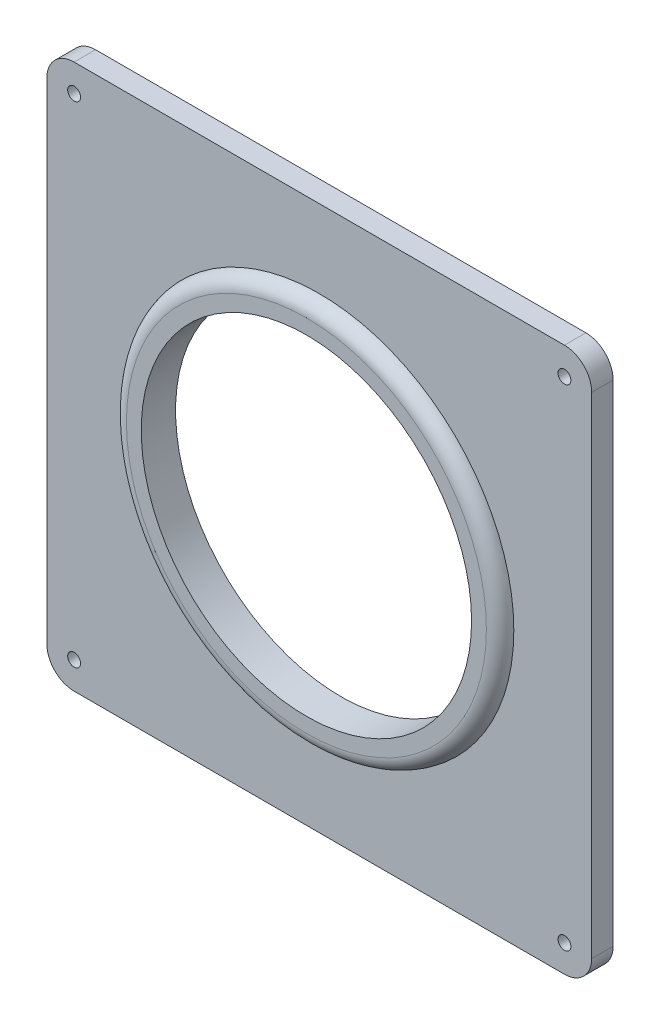
ISO-10303-21;
HEADER;
FILE_DESCRIPTION(('STEP AP214'),'2;1');
FILE_NAME('part.step','',(''),(''),'','','');
FILE_SCHEMA(('AUTOMOTIVE_DESIGN { 1 0 10303 214 1 1 1 1 }'));
ENDSEC;
DATA;
#1=APPLICATION_CONTEXT('core data for automotive mechanical design processes');
#2=APPLICATION_PROTOCOL_DEFINITION('international standard','automotive_design',2000,#1);
#3=PRODUCT_CONTEXT('',#1,'mechanical');
#4=PRODUCT('Part','Part','',(#3));
#5=PRODUCT_RELATED_PRODUCT_CATEGORY('part','',(#4));
#6=PRODUCT_DEFINITION_FORMATION('','',#4);
#7=PRODUCT_DEFINITION_CONTEXT('part definition',#1,'design');
#8=PRODUCT_DEFINITION('design','',#6,#7);
#9=PRODUCT_DEFINITION_SHAPE('','',#8);
#10=(LENGTH_UNIT() NAMED_UNIT(*) SI_UNIT(.MILLI.,.METRE.));
#11=(NAMED_UNIT(*) PLANE_ANGLE_UNIT() SI_UNIT($,.RADIAN.));
#12=(NAMED_UNIT(*) SI_UNIT($,.STERADIAN.) SOLID_ANGLE_UNIT());
#13=UNCERTAINTY_MEASURE_WITH_UNIT(LENGTH_MEASURE(1.E-05),#10,'distance_accuracy_value','');
#14=(GEOMETRIC_REPRESENTATION_CONTEXT(3) GLOBAL_UNCERTAINTY_ASSIGNED_CONTEXT((#13)) GLOBAL_UNIT_ASSIGNED_CONTEXT((#10,
#11,#12)) REPRESENTATION_CONTEXT('',''));
#15=CARTESIAN_POINT('',(0.,0.,0.));
#16=DIRECTION('',(0.,0.,1.));
#17=DIRECTION('',(1.,0.,0.));
#18=AXIS2_PLACEMENT_3D('',#15,#16,#17);
#19=CARTESIAN_POINT('',(0.,0.,5.));
#20=DIRECTION('',(0.,0.,1.));
#21=DIRECTION('',(1.,0.,0.));
#22=AXIS2_PLACEMENT_3D('',#19,#20,#21);
#23=PLANE('',#22);
#24=CARTESIAN_POINT('',(-57.15,-57.15,5.));
#25=DIRECTION('',(0.,0.,1.));
#26=DIRECTION('',(1.,0.,0.));
#27=AXIS2_PLACEMENT_3D('',#24,#25,#26);
#28=CIRCLE('',#27,1.5);
#29=CARTESIAN_POINT('',(-55.65,-57.15,5.));
#30=VERTEX_POINT('',#29);
#31=EDGE_CURVE('E241',#30,#30,#28,.F.);
#32=ORIENTED_EDGE('',*,*,#31,.T.);
#33=EDGE_LOOP('',(#32));
#34=FACE_BOUND('',#33,.T.);
#35=CARTESIAN_POINT('',(-57.15,57.15,5.));
#36=DIRECTION('',(0.,0.,1.));
#37=DIRECTION('',(1.,0.,0.));
#38=AXIS2_PLACEMENT_3D('',#35,#36,#37);
#39=CIRCLE('',#38,1.5);
#40=CARTESIAN_POINT('',(-55.65,57.15,5.));
#41=VERTEX_POINT('',#40);
#42=EDGE_CURVE('E217',#41,#41,#39,.T.);
#43=ORIENTED_EDGE('',*,*,#42,.F.);
#44=EDGE_LOOP('',(#43));
#45=FACE_BOUND('',#44,.T.);
#46=DIRECTION('',(0.,1.,0.));
#47=VECTOR('',#46,1.);
#48=CARTESIAN_POINT('',(63.5,0.,5.));
#49=LINE('',#48,#47);
#50=CARTESIAN_POINT('',(63.5,-57.15,5.));
#51=VERTEX_POINT('',#50);
#52=CARTESIAN_POINT('',(63.5,57.15,5.));
#53=VERTEX_POINT('',#52);
#54=EDGE_CURVE('E141',#51,#53,#49,.T.);
#55=ORIENTED_EDGE('',*,*,#54,.T.);
#56=CARTESIAN_POINT('',(57.15,57.15,5.));
#57=DIRECTION('',(0.,0.,1.));
#58=DIRECTION('',(1.,0.,0.));
#59=AXIS2_PLACEMENT_3D('',#56,#57,#58);
#60=CIRCLE('',#59,6.35);
#61=CARTESIAN_POINT('',(57.15,63.5,5.));
#62=VERTEX_POINT('',#61);
#63=EDGE_CURVE('E167',#53,#62,#60,.T.);
#64=ORIENTED_EDGE('',*,*,#63,.T.);
#65=DIRECTION('',(1.,0.,0.));
#66=VECTOR('',#65,1.);
#67=CARTESIAN_POINT('',(0.,63.5,5.));
#68=LINE('',#67,#66);
#69=CARTESIAN_POINT('',(-57.15,63.5,5.));
#70=VERTEX_POINT('',#69);
#71=EDGE_CURVE('E136',#70,#62,#68,.T.);
#72=ORIENTED_EDGE('',*,*,#71,.F.);
#73=CARTESIAN_POINT('',(-57.15,57.15,5.));
#74=DIRECTION('',(0.,0.,1.));
#75=DIRECTION('',(1.,0.,0.));
#76=AXIS2_PLACEMENT_3D('',#73,#74,#75);
#77=CIRCLE('',#76,6.35);
#78=CARTESIAN_POINT('',(-63.5,57.15,5.));
#79=VERTEX_POINT('',#78);
#80=EDGE_CURVE('E134',#70,#79,#77,.T.);
#81=ORIENTED_EDGE('',*,*,#80,.T.);
#82=DIRECTION('',(0.,1.,0.));
#83=VECTOR('',#82,1.);
#84=CARTESIAN_POINT('',(-63.5,0.,5.));
#85=LINE('',#84,#83);
#86=CARTESIAN_POINT('',(-63.5,-57.15,5.));
#87=VERTEX_POINT('',#86);
#88=EDGE_CURVE('E183',#87,#79,#85,.T.);
#89=ORIENTED_EDGE('',*,*,#88,.F.);
#90=CARTESIAN_POINT('',(-57.15,-57.15,5.));
#91=DIRECTION('',(0.,0.,1.));
#92=DIRECTION('',(1.,0.,0.));
#93=AXIS2_PLACEMENT_3D('',#90,#91,#92);
#94=CIRCLE('',#93,6.35);
#95=CARTESIAN_POINT('',(-57.15,-63.5,5.));
#96=VERTEX_POINT('',#95);
#97=EDGE_CURVE('E61',#87,#96,#94,.T.);
#98=ORIENTED_EDGE('',*,*,#97,.T.);
#99=DIRECTION('',(1.,0.,0.));
#100=VECTOR('',#99,1.);
#101=CARTESIAN_POINT('',(0.,-63.5,5.));
#102=LINE('',#101,#100);
#103=CARTESIAN_POINT('',(57.15,-63.5,5.));
#104=VERTEX_POINT('',#103);
#105=EDGE_CURVE('E188',#96,#104,#102,.T.);
#106=ORIENTED_EDGE('',*,*,#105,.T.);
#107=CARTESIAN_POINT('',(57.15,-57.15,5.));
#108=DIRECTION('',(0.,0.,1.));
#109=DIRECTION('',(1.,0.,0.));
#110=AXIS2_PLACEMENT_3D('',#107,#108,#109);
#111=CIRCLE('',#110,6.35);
#112=EDGE_CURVE('E164',#104,#51,#111,.T.);
#113=ORIENTED_EDGE('',*,*,#112,.T.);
#114=EDGE_LOOP('',(#55,#64,#72,#81,#89,#98,#106,#113));
#115=FACE_BOUND('',#114,.T.);
#116=CARTESIAN_POINT('',(0.,0.,5.));
#117=DIRECTION('',(0.,0.,1.));
#118=DIRECTION('',(1.,0.,0.));
#119=AXIS2_PLACEMENT_3D('',#116,#117,#118);
#120=CIRCLE('',#119,45.35);
#121=CARTESIAN_POINT('',(45.35,0.,5.));
#122=VERTEX_POINT('',#121);
#123=EDGE_CURVE('E202',#122,#122,#120,.T.);
#124=ORIENTED_EDGE('',*,*,#123,.F.);
#125=EDGE_LOOP('',(#124));
#126=FACE_BOUND('',#125,.T.);
#127=CARTESIAN_POINT('',(57.1499999999996,-57.1500000000004,5.));
#128=DIRECTION('',(0.,0.,1.));
#129=DIRECTION('',(1.,0.,0.));
#130=AXIS2_PLACEMENT_3D('',#127,#128,#129);
#131=CIRCLE('',#130,1.5);
#132=CARTESIAN_POINT('',(58.6499999999996,-57.1500000000004,5.));
#133=VERTEX_POINT('',#132);
#134=EDGE_CURVE('E233',#133,#133,#131,.T.);
#135=ORIENTED_EDGE('',*,*,#134,.F.);
#136=EDGE_LOOP('',(#135));
#137=FACE_BOUND('',#136,.T.);
#138=CARTESIAN_POINT('',(57.1499999999996,57.1500000000004,5.));
#139=DIRECTION('',(0.,0.,1.));
#140=DIRECTION('',(1.,0.,0.));
#141=AXIS2_PLACEMENT_3D('',#138,#139,#140);
#142=CIRCLE('',#141,1.5);
#143=CARTESIAN_POINT('',(58.6499999999996,57.1500000000004,5.));
#144=VERTEX_POINT('',#143);
#145=EDGE_CURVE('E225',#144,#144,#142,.F.);
#146=ORIENTED_EDGE('',*,*,#145,.T.);
#147=EDGE_LOOP('',(#146));
#148=FACE_BOUND('',#147,.T.);
#149=ADVANCED_FACE('F38',(#34,#45,#115,#126,#137,#148),#23,.T.);
#150=CARTESIAN_POINT('',(0.,0.,0.));
#151=DIRECTION('',(0.,0.,1.));
#152=DIRECTION('',(1.,0.,0.));
#153=AXIS2_PLACEMENT_3D('',#150,#151,#152);
#154=PLANE('',#153);
#155=CARTESIAN_POINT('',(57.1499999999996,-57.1500000000004,0.));
#156=DIRECTION('',(0.,0.,1.));
#157=DIRECTION('',(1.,0.,0.));
#158=AXIS2_PLACEMENT_3D('',#155,#156,#157);
#159=CIRCLE('',#158,1.5);
#160=CARTESIAN_POINT('',(58.6499999999996,-57.1500000000004,0.));
#161=VERTEX_POINT('',#160);
#162=EDGE_CURVE('E237',#161,#161,#159,.T.);
#163=ORIENTED_EDGE('',*,*,#162,.T.);
#164=EDGE_LOOP('',(#163));
#165=FACE_BOUND('',#164,.T.);
#166=CARTESIAN_POINT('',(-57.15,57.15,0.));
#167=DIRECTION('',(0.,0.,1.));
#168=DIRECTION('',(1.,0.,0.));
#169=AXIS2_PLACEMENT_3D('',#166,#167,#168);
#170=CIRCLE('',#169,1.5);
#171=CARTESIAN_POINT('',(-55.65,57.15,0.));
#172=VERTEX_POINT('',#171);
#173=EDGE_CURVE('E216',#172,#172,#170,.T.);
#174=ORIENTED_EDGE('',*,*,#173,.T.);
#175=EDGE_LOOP('',(#174));
#176=FACE_BOUND('',#175,.T.);
#177=DIRECTION('',(1.,0.,0.));
#178=VECTOR('',#177,1.);
#179=CARTESIAN_POINT('',(0.,63.5,0.));
#180=LINE('',#179,#178);
#181=CARTESIAN_POINT('',(-57.15,63.5,0.));
#182=VERTEX_POINT('',#181);
#183=CARTESIAN_POINT('',(57.15,63.5,0.));
#184=VERTEX_POINT('',#183);
#185=EDGE_CURVE('E110',#182,#184,#180,.T.);
#186=ORIENTED_EDGE('',*,*,#185,.T.);
#187=CARTESIAN_POINT('',(57.15,57.15,0.));
#188=DIRECTION('',(0.,0.,1.));
#189=DIRECTION('',(1.,0.,0.));
#190=AXIS2_PLACEMENT_3D('',#187,#188,#189);
#191=CIRCLE('',#190,6.35);
#192=CARTESIAN_POINT('',(63.5,57.15,0.));
#193=VERTEX_POINT('',#192);
#194=EDGE_CURVE('E150',#184,#193,#191,.F.);
#195=ORIENTED_EDGE('',*,*,#194,.T.);
#196=DIRECTION('',(0.,1.,0.));
#197=VECTOR('',#196,1.);
#198=CARTESIAN_POINT('',(63.5,0.,0.));
#199=LINE('',#198,#197);
#200=CARTESIAN_POINT('',(63.5,-57.15,0.));
#201=VERTEX_POINT('',#200);
#202=EDGE_CURVE('E130',#201,#193,#199,.T.);
#203=ORIENTED_EDGE('',*,*,#202,.F.);
#204=CARTESIAN_POINT('',(57.15,-57.15,0.));
#205=DIRECTION('',(0.,0.,1.));
#206=DIRECTION('',(1.,0.,0.));
#207=AXIS2_PLACEMENT_3D('',#204,#205,#206);
#208=CIRCLE('',#207,6.35);
#209=CARTESIAN_POINT('',(57.15,-63.5,0.));
#210=VERTEX_POINT('',#209);
#211=EDGE_CURVE('E147',#201,#210,#208,.F.);
#212=ORIENTED_EDGE('',*,*,#211,.T.);
#213=DIRECTION('',(1.,0.,0.));
#214=VECTOR('',#213,1.);
#215=CARTESIAN_POINT('',(0.,-63.5,0.));
#216=LINE('',#215,#214);
#217=CARTESIAN_POINT('',(-57.15,-63.5,0.));
#218=VERTEX_POINT('',#217);
#219=EDGE_CURVE('E194',#218,#210,#216,.T.);
#220=ORIENTED_EDGE('',*,*,#219,.F.);
#221=CARTESIAN_POINT('',(-57.15,-57.15,0.));
#222=DIRECTION('',(0.,0.,1.));
#223=DIRECTION('',(1.,0.,0.));
#224=AXIS2_PLACEMENT_3D('',#221,#222,#223);
#225=CIRCLE('',#224,6.35);
#226=CARTESIAN_POINT('',(-63.5,-57.15,0.));
#227=VERTEX_POINT('',#226);
#228=EDGE_CURVE('E118',#218,#227,#225,.F.);
#229=ORIENTED_EDGE('',*,*,#228,.T.);
#230=DIRECTION('',(0.,1.,0.));
#231=VECTOR('',#230,1.);
#232=CARTESIAN_POINT('',(-63.5,0.,0.));
#233=LINE('',#232,#231);
#234=CARTESIAN_POINT('',(-63.5,57.15,0.));
#235=VERTEX_POINT('',#234);
#236=EDGE_CURVE('E112',#227,#235,#233,.T.);
#237=ORIENTED_EDGE('',*,*,#236,.T.);
#238=CARTESIAN_POINT('',(-57.15,57.15,0.));
#239=DIRECTION('',(0.,0.,1.));
#240=DIRECTION('',(1.,0.,0.));
#241=AXIS2_PLACEMENT_3D('',#238,#239,#240);
#242=CIRCLE('',#241,6.35);
#243=EDGE_CURVE('E106',#235,#182,#242,.F.);
#244=ORIENTED_EDGE('',*,*,#243,.T.);
#245=EDGE_LOOP('',(#186,#195,#203,#212,#220,#229,#237,#244));
#246=FACE_BOUND('',#245,.T.);
#247=CARTESIAN_POINT('',(0.,0.,0.));
#248=DIRECTION('',(0.,0.,1.));
#249=DIRECTION('',(1.,0.,0.));
#250=AXIS2_PLACEMENT_3D('',#247,#248,#249);
#251=CIRCLE('',#250,38.5);
#252=CARTESIAN_POINT('',(38.5,0.,0.));
#253=VERTEX_POINT('',#252);
#254=EDGE_CURVE('E129',#253,#253,#251,.T.);
#255=ORIENTED_EDGE('',*,*,#254,.T.);
#256=EDGE_LOOP('',(#255));
#257=FACE_BOUND('',#256,.T.);
#258=CARTESIAN_POINT('',(-57.15,-57.15,0.));
#259=DIRECTION('',(0.,0.,1.));
#260=DIRECTION('',(1.,0.,0.));
#261=AXIS2_PLACEMENT_3D('',#258,#259,#260);
#262=CIRCLE('',#261,1.5);
#263=CARTESIAN_POINT('',(-55.65,-57.15,0.));
#264=VERTEX_POINT('',#263);
#265=EDGE_CURVE('E221',#264,#264,#262,.F.);
#266=ORIENTED_EDGE('',*,*,#265,.F.);
#267=EDGE_LOOP('',(#266));
#268=FACE_BOUND('',#267,.T.);
#269=CARTESIAN_POINT('',(57.1499999999996,57.1500000000004,0.));
#270=DIRECTION('',(0.,0.,1.));
#271=DIRECTION('',(1.,0.,0.));
#272=AXIS2_PLACEMENT_3D('',#269,#270,#271);
#273=CIRCLE('',#272,1.5);
#274=CARTESIAN_POINT('',(58.6499999999996,57.1500000000004,0.));
#275=VERTEX_POINT('',#274);
#276=EDGE_CURVE('E229',#275,#275,#273,.F.);
#277=ORIENTED_EDGE('',*,*,#276,.F.);
#278=EDGE_LOOP('',(#277));
#279=FACE_BOUND('',#278,.T.);
#280=ADVANCED_FACE('F108',(#165,#176,#246,#257,#268,#279),#154,.F.);
#281=CARTESIAN_POINT('',(-63.5,0.,5.));
#282=DIRECTION('',(-1.,0.,0.));
#283=DIRECTION('',(0.,0.,1.));
#284=AXIS2_PLACEMENT_3D('',#281,#282,#283);
#285=PLANE('',#284);
#286=ORIENTED_EDGE('',*,*,#236,.F.);
#287=DIRECTION('',(0.,0.,-1.));
#288=VECTOR('',#287,1.);
#289=CARTESIAN_POINT('',(-63.5,-57.15,5.));
#290=LINE('',#289,#288);
#291=EDGE_CURVE('E47',#227,#87,#290,.F.);
#292=ORIENTED_EDGE('',*,*,#291,.T.);
#293=ORIENTED_EDGE('',*,*,#88,.T.);
#294=DIRECTION('',(0.,0.,-1.));
#295=VECTOR('',#294,1.);
#296=CARTESIAN_POINT('',(-63.5,57.15,5.));
#297=LINE('',#296,#295);
#298=EDGE_CURVE('E176',#79,#235,#297,.T.);
#299=ORIENTED_EDGE('',*,*,#298,.T.);
#300=EDGE_LOOP('',(#286,#292,#293,#299));
#301=FACE_BOUND('',#300,.T.);
#302=ADVANCED_FACE('F182',(#301),#285,.T.);
#303=CARTESIAN_POINT('',(0.,-63.5,5.));
#304=DIRECTION('',(0.,1.,0.));
#305=DIRECTION('',(0.,0.,1.));
#306=AXIS2_PLACEMENT_3D('',#303,#304,#305);
#307=PLANE('',#306);
#308=ORIENTED_EDGE('',*,*,#219,.T.);
#309=DIRECTION('',(0.,0.,-1.));
#310=VECTOR('',#309,1.);
#311=CARTESIAN_POINT('',(57.15,-63.5,5.));
#312=LINE('',#311,#310);
#313=EDGE_CURVE('E54',#210,#104,#312,.F.);
#314=ORIENTED_EDGE('',*,*,#313,.T.);
#315=ORIENTED_EDGE('',*,*,#105,.F.);
#316=DIRECTION('',(0.,0.,-1.));
#317=VECTOR('',#316,1.);
#318=CARTESIAN_POINT('',(-57.15,-63.5,0.));
#319=LINE('',#318,#317);
#320=EDGE_CURVE('E170',#96,#218,#319,.T.);
#321=ORIENTED_EDGE('',*,*,#320,.T.);
#322=EDGE_LOOP('',(#308,#314,#315,#321));
#323=FACE_BOUND('',#322,.T.);
#324=ADVANCED_FACE('F193',(#323),#307,.F.);
#325=CARTESIAN_POINT('',(63.5,0.,5.));
#326=DIRECTION('',(-1.,0.,0.));
#327=DIRECTION('',(0.,0.,1.));
#328=AXIS2_PLACEMENT_3D('',#325,#326,#327);
#329=PLANE('',#328);
#330=ORIENTED_EDGE('',*,*,#202,.T.);
#331=DIRECTION('',(0.,0.,-1.));
#332=VECTOR('',#331,1.);
#333=CARTESIAN_POINT('',(63.5,57.15,5.));
#334=LINE('',#333,#332);
#335=EDGE_CURVE('E157',#193,#53,#334,.F.);
#336=ORIENTED_EDGE('',*,*,#335,.T.);
#337=ORIENTED_EDGE('',*,*,#54,.F.);
#338=DIRECTION('',(0.,0.,-1.));
#339=VECTOR('',#338,1.);
#340=CARTESIAN_POINT('',(63.5,-57.15,5.));
#341=LINE('',#340,#339);
#342=EDGE_CURVE('E153',#51,#201,#341,.T.);
#343=ORIENTED_EDGE('',*,*,#342,.T.);
#344=EDGE_LOOP('',(#330,#336,#337,#343));
#345=FACE_BOUND('',#344,.T.);
#346=ADVANCED_FACE('F282',(#345),#329,.F.);
#347=CARTESIAN_POINT('',(0.,63.5,5.));
#348=DIRECTION('',(0.,1.,0.));
#349=DIRECTION('',(0.,0.,1.));
#350=AXIS2_PLACEMENT_3D('',#347,#348,#349);
#351=PLANE('',#350);
#352=ORIENTED_EDGE('',*,*,#71,.T.);
#353=DIRECTION('',(0.,0.,-1.));
#354=VECTOR('',#353,1.);
#355=CARTESIAN_POINT('',(57.15,63.5,0.));
#356=LINE('',#355,#354);
#357=EDGE_CURVE('E119',#62,#184,#356,.T.);
#358=ORIENTED_EDGE('',*,*,#357,.T.);
#359=ORIENTED_EDGE('',*,*,#185,.F.);
#360=DIRECTION('',(0.,0.,-1.));
#361=VECTOR('',#360,1.);
#362=CARTESIAN_POINT('',(-57.15,63.5,5.));
#363=LINE('',#362,#361);
#364=EDGE_CURVE('E125',#182,#70,#363,.F.);
#365=ORIENTED_EDGE('',*,*,#364,.T.);
#366=EDGE_LOOP('',(#352,#358,#359,#365));
#367=FACE_BOUND('',#366,.T.);
#368=ADVANCED_FACE('F124',(#367),#351,.T.);
#369=CARTESIAN_POINT('',(0.,0.,5.));
#370=DIRECTION('',(0.,0.,-1.));
#371=DIRECTION('',(-1.,0.,0.));
#372=AXIS2_PLACEMENT_3D('',#369,#370,#371);
#373=CYLINDRICAL_SURFACE('',#372,38.5);
#374=ORIENTED_EDGE('',*,*,#254,.F.);
#375=EDGE_LOOP('',(#374));
#376=FACE_BOUND('',#375,.T.);
#377=CARTESIAN_POINT('',(0.,0.,8.));
#378=DIRECTION('',(0.,0.,1.));
#379=DIRECTION('',(1.,0.,0.));
#380=AXIS2_PLACEMENT_3D('',#377,#378,#379);
#381=CIRCLE('',#380,38.5);
#382=CARTESIAN_POINT('',(38.5,0.,8.));
#383=VERTEX_POINT('',#382);
#384=EDGE_CURVE('E212',#383,#383,#381,.T.);
#385=ORIENTED_EDGE('',*,*,#384,.T.);
#386=EDGE_LOOP('',(#385));
#387=FACE_BOUND('',#386,.T.);
#388=ADVANCED_FACE('F276',(#376,#387),#373,.F.);
#389=CARTESIAN_POINT('',(0.,0.,8.));
#390=DIRECTION('',(0.,0.,1.));
#391=DIRECTION('',(1.,0.,0.));
#392=AXIS2_PLACEMENT_3D('',#389,#390,#391);
#393=PLANE('',#392);
#394=CARTESIAN_POINT('',(0.,0.,8.));
#395=DIRECTION('',(0.,0.,1.));
#396=DIRECTION('',(1.,0.,0.));
#397=AXIS2_PLACEMENT_3D('',#394,#395,#396);
#398=CIRCLE('',#397,41.9514709064067);
#399=CARTESIAN_POINT('',(41.9514709064067,0.,8.));
#400=VERTEX_POINT('',#399);
#401=EDGE_CURVE('E11',#400,#400,#398,.T.);
#402=ORIENTED_EDGE('',*,*,#401,.T.);
#403=EDGE_LOOP('',(#402));
#404=FACE_BOUND('',#403,.T.);
#405=ORIENTED_EDGE('',*,*,#384,.F.);
#406=EDGE_LOOP('',(#405));
#407=FACE_BOUND('',#406,.T.);
#408=ADVANCED_FACE('F273',(#404,#407),#393,.T.);
#409=CARTESIAN_POINT('',(57.15,57.15,5.));
#410=DIRECTION('',(0.,0.,1.));
#411=DIRECTION('',(1.,0.,0.));
#412=AXIS2_PLACEMENT_3D('',#409,#410,#411);
#413=CYLINDRICAL_SURFACE('',#412,6.35);
#414=ORIENTED_EDGE('',*,*,#63,.F.);
#415=ORIENTED_EDGE('',*,*,#335,.F.);
#416=ORIENTED_EDGE('',*,*,#194,.F.);
#417=ORIENTED_EDGE('',*,*,#357,.F.);
#418=EDGE_LOOP('',(#414,#415,#416,#417));
#419=FACE_BOUND('',#418,.T.);
#420=ADVANCED_FACE('F290',(#419),#413,.T.);
#421=CARTESIAN_POINT('',(57.15,-57.15,5.));
#422=DIRECTION('',(0.,0.,-1.));
#423=DIRECTION('',(-1.,0.,0.));
#424=AXIS2_PLACEMENT_3D('',#421,#422,#423);
#425=CYLINDRICAL_SURFACE('',#424,6.35);
#426=ORIENTED_EDGE('',*,*,#112,.F.);
#427=ORIENTED_EDGE('',*,*,#313,.F.);
#428=ORIENTED_EDGE('',*,*,#211,.F.);
#429=ORIENTED_EDGE('',*,*,#342,.F.);
#430=EDGE_LOOP('',(#426,#427,#428,#429));
#431=FACE_BOUND('',#430,.T.);
#432=ADVANCED_FACE('F293',(#431),#425,.T.);
#433=CARTESIAN_POINT('',(-57.15,-57.15,5.));
#434=DIRECTION('',(0.,0.,1.));
#435=DIRECTION('',(1.,0.,0.));
#436=AXIS2_PLACEMENT_3D('',#433,#434,#435);
#437=CYLINDRICAL_SURFACE('',#436,6.35);
#438=ORIENTED_EDGE('',*,*,#97,.F.);
#439=ORIENTED_EDGE('',*,*,#291,.F.);
#440=ORIENTED_EDGE('',*,*,#228,.F.);
#441=ORIENTED_EDGE('',*,*,#320,.F.);
#442=EDGE_LOOP('',(#438,#439,#440,#441));
#443=FACE_BOUND('',#442,.T.);
#444=ADVANCED_FACE('F191',(#443),#437,.T.);
#445=CARTESIAN_POINT('',(-57.15,57.15,5.));
#446=DIRECTION('',(0.,0.,-1.));
#447=DIRECTION('',(-1.,0.,0.));
#448=AXIS2_PLACEMENT_3D('',#445,#446,#447);
#449=CYLINDRICAL_SURFACE('',#448,6.35);
#450=ORIENTED_EDGE('',*,*,#80,.F.);
#451=ORIENTED_EDGE('',*,*,#364,.F.);
#452=ORIENTED_EDGE('',*,*,#243,.F.);
#453=ORIENTED_EDGE('',*,*,#298,.F.);
#454=EDGE_LOOP('',(#450,#451,#452,#453));
#455=FACE_BOUND('',#454,.T.);
#456=ADVANCED_FACE('F133',(#455),#449,.T.);
#457=CARTESIAN_POINT('',(0.,0.,4.575));
#458=DIRECTION('',(0.,0.,-1.));
#459=DIRECTION('',(-1.,0.,0.));
#460=AXIS2_PLACEMENT_3D('',#457,#458,#459);
#461=TOROIDAL_SURFACE('',#460,41.9514709064067,3.425);
#462=ORIENTED_EDGE('',*,*,#123,.T.);
#463=EDGE_LOOP('',(#462));
#464=FACE_BOUND('',#463,.T.);
#465=ORIENTED_EDGE('',*,*,#401,.F.);
#466=EDGE_LOOP('',(#465));
#467=FACE_BOUND('',#466,.T.);
#468=ADVANCED_FACE('F40',(#464,#467),#461,.T.);
#469=CARTESIAN_POINT('',(-57.15,57.15,0.));
#470=DIRECTION('',(0.,0.,1.));
#471=DIRECTION('',(1.,0.,0.));
#472=AXIS2_PLACEMENT_3D('',#469,#470,#471);
#473=CYLINDRICAL_SURFACE('',#472,1.5);
#474=ORIENTED_EDGE('',*,*,#173,.F.);
#475=EDGE_LOOP('',(#474));
#476=FACE_BOUND('',#475,.T.);
#477=ORIENTED_EDGE('',*,*,#42,.T.);
#478=EDGE_LOOP('',(#477));
#479=FACE_BOUND('',#478,.T.);
#480=ADVANCED_FACE('F303',(#476,#479),#473,.F.);
#481=CARTESIAN_POINT('',(-57.15,-57.15,0.));
#482=DIRECTION('',(0.,0.,1.));
#483=DIRECTION('',(1.,0.,0.));
#484=AXIS2_PLACEMENT_3D('',#481,#482,#483);
#485=CYLINDRICAL_SURFACE('',#484,1.5);
#486=ORIENTED_EDGE('',*,*,#265,.T.);
#487=EDGE_LOOP('',(#486));
#488=FACE_BOUND('',#487,.T.);
#489=ORIENTED_EDGE('',*,*,#31,.F.);
#490=EDGE_LOOP('',(#489));
#491=FACE_BOUND('',#490,.T.);
#492=ADVANCED_FACE('F249',(#488,#491),#485,.F.);
#493=CARTESIAN_POINT('',(57.1499999999996,-57.1500000000004,0.));
#494=DIRECTION('',(0.,0.,1.));
#495=DIRECTION('',(1.,0.,0.));
#496=AXIS2_PLACEMENT_3D('',#493,#494,#495);
#497=CYLINDRICAL_SURFACE('',#496,1.5);
#498=ORIENTED_EDGE('',*,*,#162,.F.);
#499=EDGE_LOOP('',(#498));
#500=FACE_BOUND('',#499,.T.);
#501=ORIENTED_EDGE('',*,*,#134,.T.);
#502=EDGE_LOOP('',(#501));
#503=FACE_BOUND('',#502,.T.);
#504=ADVANCED_FACE('F261',(#500,#503),#497,.F.);
#505=CARTESIAN_POINT('',(57.1499999999996,57.1500000000004,0.));
#506=DIRECTION('',(0.,0.,1.));
#507=DIRECTION('',(1.,0.,0.));
#508=AXIS2_PLACEMENT_3D('',#505,#506,#507);
#509=CYLINDRICAL_SURFACE('',#508,1.5);
#510=ORIENTED_EDGE('',*,*,#276,.T.);
#511=EDGE_LOOP('',(#510));
#512=FACE_BOUND('',#511,.T.);
#513=ORIENTED_EDGE('',*,*,#145,.F.);
#514=EDGE_LOOP('',(#513));
#515=FACE_BOUND('',#514,.T.);
#516=ADVANCED_FACE('F258',(#512,#515),#509,.F.);
#517=CLOSED_SHELL('',(#149,#280,#302,#324,#346,#368,#388,#408,#420,#432,#444,#456,#468,#480,
#492,#504,#516));
#518=MANIFOLD_SOLID_BREP('B2',#517);
#519=ADVANCED_BREP_SHAPE_REPRESENTATION('',(#18,#518),#14);
#520=SHAPE_DEFINITION_REPRESENTATION(#9,#519);
ENDSEC;
END-ISO-10303-21;
